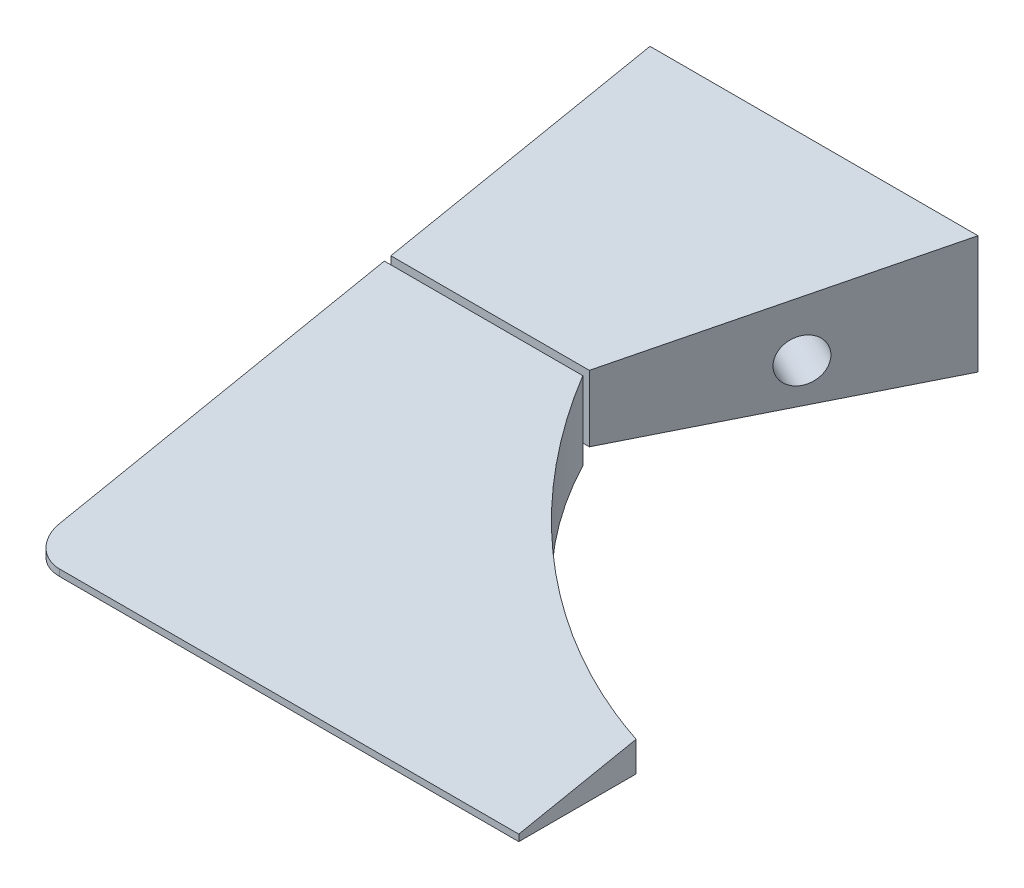
ISO-10303-21;
HEADER;
FILE_DESCRIPTION(('STEP AP214'),'2;1');
FILE_NAME('part.step','',(''),(''),'','','');
FILE_SCHEMA(('AUTOMOTIVE_DESIGN { 1 0 10303 214 1 1 1 1 }'));
ENDSEC;
DATA;
#1=APPLICATION_CONTEXT('core data for automotive mechanical design processes');
#2=APPLICATION_PROTOCOL_DEFINITION('international standard','automotive_design',2000,#1);
#3=PRODUCT_CONTEXT('',#1,'mechanical');
#4=PRODUCT('Part','Part','',(#3));
#5=PRODUCT_RELATED_PRODUCT_CATEGORY('part','',(#4));
#6=PRODUCT_DEFINITION_FORMATION('','',#4);
#7=PRODUCT_DEFINITION_CONTEXT('part definition',#1,'design');
#8=PRODUCT_DEFINITION('design','',#6,#7);
#9=PRODUCT_DEFINITION_SHAPE('','',#8);
#10=(LENGTH_UNIT() NAMED_UNIT(*) SI_UNIT(.MILLI.,.METRE.));
#11=(NAMED_UNIT(*) PLANE_ANGLE_UNIT() SI_UNIT($,.RADIAN.));
#12=(NAMED_UNIT(*) SI_UNIT($,.STERADIAN.) SOLID_ANGLE_UNIT());
#13=UNCERTAINTY_MEASURE_WITH_UNIT(LENGTH_MEASURE(1.E-05),#10,'distance_accuracy_value','');
#14=(GEOMETRIC_REPRESENTATION_CONTEXT(3) GLOBAL_UNCERTAINTY_ASSIGNED_CONTEXT((#13)) GLOBAL_UNIT_ASSIGNED_CONTEXT((#10,
#11,#12)) REPRESENTATION_CONTEXT('',''));
#15=CARTESIAN_POINT('',(0.,0.,0.));
#16=DIRECTION('',(0.,0.,1.));
#17=DIRECTION('',(1.,0.,0.));
#18=AXIS2_PLACEMENT_3D('',#15,#16,#17);
#19=CARTESIAN_POINT('',(0.,0.,95.));
#20=DIRECTION('',(0.,0.,1.));
#21=DIRECTION('',(1.,0.,0.));
#22=AXIS2_PLACEMENT_3D('',#19,#20,#21);
#23=PLANE('',#22);
#24=DIRECTION('',(0.,1.,0.));
#25=VECTOR('',#24,1.);
#26=CARTESIAN_POINT('',(9.99999999999999,-24.1308719192986,95.));
#27=LINE('',#26,#25);
#28=CARTESIAN_POINT('',(9.99999999999999,-10.,95.));
#29=VERTEX_POINT('',#28);
#30=CARTESIAN_POINT('',(10.,-9.,95.));
#31=VERTEX_POINT('',#30);
#32=EDGE_CURVE('E324',#29,#31,#27,.T.);
#33=ORIENTED_EDGE('',*,*,#32,.T.);
#34=DIRECTION('',(1.,0.,0.));
#35=VECTOR('',#34,1.);
#36=CARTESIAN_POINT('',(-330.312259244849,-9.,95.));
#37=LINE('',#36,#35);
#38=CARTESIAN_POINT('',(-60.,-9.,95.));
#39=VERTEX_POINT('',#38);
#40=EDGE_CURVE('E268',#39,#31,#37,.T.);
#41=ORIENTED_EDGE('',*,*,#40,.F.);
#42=DIRECTION('',(0.,-1.,0.));
#43=VECTOR('',#42,1.);
#44=CARTESIAN_POINT('',(-60.,-10.,95.));
#45=LINE('',#44,#43);
#46=CARTESIAN_POINT('',(-60.,-10.,95.));
#47=VERTEX_POINT('',#46);
#48=EDGE_CURVE('E291',#39,#47,#45,.T.);
#49=ORIENTED_EDGE('',*,*,#48,.T.);
#50=DIRECTION('',(1.,0.,0.));
#51=VECTOR('',#50,1.);
#52=CARTESIAN_POINT('',(-65.,-10.,95.));
#53=LINE('',#52,#51);
#54=EDGE_CURVE('E283',#47,#29,#53,.T.);
#55=ORIENTED_EDGE('',*,*,#54,.T.);
#56=EDGE_LOOP('',(#33,#41,#49,#55));
#57=FACE_BOUND('',#56,.T.);
#58=ADVANCED_FACE('F41',(#57),#23,.T.);
#59=CARTESIAN_POINT('',(-60.,0.,90.));
#60=DIRECTION('',(0.,1.,0.));
#61=DIRECTION('',(0.,0.,1.));
#62=AXIS2_PLACEMENT_3D('',#59,#60,#61);
#63=CYLINDRICAL_SURFACE('',#62,5.);
#64=CARTESIAN_POINT('',(-60.,-8.,90.));
#65=DIRECTION('',(0.,0.98058067569092,0.196116135138184));
#66=DIRECTION('',(0.,0.196116135138184,-0.98058067569092));
#67=AXIS2_PLACEMENT_3D('',#64,#65,#66);
#68=ELLIPSE('',#67,5.09901951359278,5.);
#69=CARTESIAN_POINT('',(-65.,-8.00000000000001,90.));
#70=VERTEX_POINT('',#69);
#71=EDGE_CURVE('E302',#70,#39,#68,.T.);
#72=ORIENTED_EDGE('',*,*,#71,.F.);
#73=DIRECTION('',(0.,-1.,0.));
#74=VECTOR('',#73,1.);
#75=CARTESIAN_POINT('',(-65.,-9.,90.));
#76=LINE('',#75,#74);
#77=CARTESIAN_POINT('',(-65.,-10.,90.));
#78=VERTEX_POINT('',#77);
#79=EDGE_CURVE('E298',#78,#70,#76,.F.);
#80=ORIENTED_EDGE('',*,*,#79,.F.);
#81=CARTESIAN_POINT('',(-60.,-10.,90.));
#82=DIRECTION('',(0.,1.,0.));
#83=DIRECTION('',(0.,0.,1.));
#84=AXIS2_PLACEMENT_3D('',#81,#82,#83);
#85=CIRCLE('',#84,5.);
#86=EDGE_CURVE('E295',#47,#78,#85,.F.);
#87=ORIENTED_EDGE('',*,*,#86,.F.);
#88=ORIENTED_EDGE('',*,*,#48,.F.);
#89=EDGE_LOOP('',(#72,#80,#87,#88));
#90=FACE_BOUND('',#89,.T.);
#91=ADVANCED_FACE('F43',(#90),#63,.T.);
#92=CARTESIAN_POINT('',(-330.312259244849,10.,0.));
#93=DIRECTION('',(0.,0.98058067569092,0.196116135138184));
#94=DIRECTION('',(0.,-0.196116135138184,0.98058067569092));
#95=AXIS2_PLACEMENT_3D('',#92,#93,#94);
#96=PLANE('',#95);
#97=DIRECTION('',(0.,-0.196116135138184,0.98058067569092));
#98=VECTOR('',#97,1.);
#99=CARTESIAN_POINT('',(9.99999999999999,-4.89894884237549,74.4947442118774));
#100=LINE('',#99,#98);
#101=CARTESIAN_POINT('',(9.99999999999999,-5.42196709872822,77.1098354936411));
#102=VERTEX_POINT('',#101);
#103=EDGE_CURVE('E175',#102,#31,#100,.T.);
#104=ORIENTED_EDGE('',*,*,#103,.F.);
#105=CARTESIAN_POINT('',(30.4043354410162,8.69431773620242,6.5284113189879));
#106=DIRECTION('',(0.,0.98058067569092,0.196116135138184));
#107=DIRECTION('',(0.,0.196116135138184,-0.98058067569092));
#108=AXIS2_PLACEMENT_3D('',#105,#106,#107);
#109=ELLIPSE('',#108,74.9266128758287,73.4715886810121);
#110=CARTESIAN_POINT('',(-34.741696715977,1.9,40.5));
#111=VERTEX_POINT('',#110);
#112=EDGE_CURVE('E272',#111,#102,#109,.T.);
#113=ORIENTED_EDGE('',*,*,#112,.F.);
#114=DIRECTION('',(-1.,0.,0.));
#115=VECTOR('',#114,1.);
#116=CARTESIAN_POINT('',(-330.312259244849,1.9,40.5));
#117=LINE('',#116,#115);
#118=CARTESIAN_POINT('',(-65.,1.9,40.5));
#119=VERTEX_POINT('',#118);
#120=EDGE_CURVE('E50',#111,#119,#117,.T.);
#121=ORIENTED_EDGE('',*,*,#120,.T.);
#122=DIRECTION('',(0.,-0.196116135138184,0.98058067569092));
#123=VECTOR('',#122,1.);
#124=CARTESIAN_POINT('',(-65.,-8.26923076923077,91.3461538461538));
#125=LINE('',#124,#123);
#126=EDGE_CURVE('E276',#119,#70,#125,.T.);
#127=ORIENTED_EDGE('',*,*,#126,.T.);
#128=ORIENTED_EDGE('',*,*,#71,.T.);
#129=ORIENTED_EDGE('',*,*,#40,.T.);
#130=EDGE_LOOP('',(#104,#113,#121,#127,#128,#129));
#131=FACE_BOUND('',#130,.T.);
#132=ADVANCED_FACE('F311',(#131),#96,.T.);
#133=CARTESIAN_POINT('',(-65.,-10.,95.));
#134=DIRECTION('',(0.,1.,0.));
#135=DIRECTION('',(0.,0.,1.));
#136=AXIS2_PLACEMENT_3D('',#133,#134,#135);
#137=PLANE('',#136);
#138=CARTESIAN_POINT('',(30.4043354410162,-10.,6.5284113189879));
#139=DIRECTION('',(0.,1.,0.));
#140=DIRECTION('',(0.,0.,1.));
#141=AXIS2_PLACEMENT_3D('',#138,#139,#140);
#142=CIRCLE('',#141,73.4715886810121);
#143=CARTESIAN_POINT('',(-34.7416967159767,-10.,40.5));
#144=VERTEX_POINT('',#143);
#145=CARTESIAN_POINT('',(9.99999999999999,-10.,77.1098354936411));
#146=VERTEX_POINT('',#145);
#147=EDGE_CURVE('E279',#144,#146,#142,.T.);
#148=ORIENTED_EDGE('',*,*,#147,.T.);
#149=DIRECTION('',(0.,0.,-1.));
#150=VECTOR('',#149,1.);
#151=CARTESIAN_POINT('',(9.99999999999999,-10.,70.6483595964928));
#152=LINE('',#151,#150);
#153=EDGE_CURVE('E64',#29,#146,#152,.T.);
#154=ORIENTED_EDGE('',*,*,#153,.F.);
#155=ORIENTED_EDGE('',*,*,#54,.F.);
#156=ORIENTED_EDGE('',*,*,#86,.T.);
#157=DIRECTION('',(0.,0.,-1.));
#158=VECTOR('',#157,1.);
#159=CARTESIAN_POINT('',(-65.,-10.,95.));
#160=LINE('',#159,#158);
#161=CARTESIAN_POINT('',(-65.,-10.,40.5));
#162=VERTEX_POINT('',#161);
#163=EDGE_CURVE('E287',#78,#162,#160,.T.);
#164=ORIENTED_EDGE('',*,*,#163,.T.);
#165=DIRECTION('',(-1.,0.,0.));
#166=VECTOR('',#165,1.);
#167=CARTESIAN_POINT('',(65.,-10.,40.5));
#168=LINE('',#167,#166);
#169=EDGE_CURVE('E261',#144,#162,#168,.T.);
#170=ORIENTED_EDGE('',*,*,#169,.F.);
#171=EDGE_LOOP('',(#148,#154,#155,#156,#164,#170));
#172=FACE_BOUND('',#171,.T.);
#173=ADVANCED_FACE('F339',(#172),#137,.F.);
#174=CARTESIAN_POINT('',(30.4043354410162,-10.001,6.5284113189879));
#175=DIRECTION('',(0.,1.,0.));
#176=DIRECTION('',(0.,0.,1.));
#177=AXIS2_PLACEMENT_3D('',#174,#175,#176);
#178=CYLINDRICAL_SURFACE('',#177,73.4715886810121);
#179=DIRECTION('',(0.,1.,0.));
#180=VECTOR('',#179,1.);
#181=CARTESIAN_POINT('',(10.,-10.001,77.1098354936411));
#182=LINE('',#181,#180);
#183=EDGE_CURVE('E326',#102,#146,#182,.F.);
#184=ORIENTED_EDGE('',*,*,#183,.T.);
#185=ORIENTED_EDGE('',*,*,#147,.F.);
#186=DIRECTION('',(0.,1.,0.));
#187=VECTOR('',#186,1.);
#188=CARTESIAN_POINT('',(-34.7416967159767,-10.001,40.5));
#189=LINE('',#188,#187);
#190=EDGE_CURVE('E265',#144,#111,#189,.T.);
#191=ORIENTED_EDGE('',*,*,#190,.T.);
#192=ORIENTED_EDGE('',*,*,#112,.T.);
#193=EDGE_LOOP('',(#184,#185,#191,#192));
#194=FACE_BOUND('',#193,.T.);
#195=ADVANCED_FACE('F336',(#194),#178,.F.);
#196=CARTESIAN_POINT('',(-65.,10.,95.));
#197=DIRECTION('',(1.,0.,0.));
#198=DIRECTION('',(0.,0.,-1.));
#199=AXIS2_PLACEMENT_3D('',#196,#197,#198);
#200=PLANE('',#199);
#201=DIRECTION('',(0.,-1.,0.));
#202=VECTOR('',#201,1.);
#203=CARTESIAN_POINT('',(-65.,0.,40.5));
#204=LINE('',#203,#202);
#205=EDGE_CURVE('E231',#119,#162,#204,.T.);
#206=ORIENTED_EDGE('',*,*,#205,.T.);
#207=ORIENTED_EDGE('',*,*,#163,.F.);
#208=ORIENTED_EDGE('',*,*,#79,.T.);
#209=ORIENTED_EDGE('',*,*,#126,.F.);
#210=EDGE_LOOP('',(#206,#207,#208,#209));
#211=FACE_BOUND('',#210,.T.);
#212=ADVANCED_FACE('F314',(#211),#200,.F.);
#213=CARTESIAN_POINT('',(65.,0.,40.5));
#214=DIRECTION('',(0.,0.,-1.));
#215=DIRECTION('',(-1.,0.,0.));
#216=AXIS2_PLACEMENT_3D('',#213,#214,#215);
#217=PLANE('',#216);
#218=ORIENTED_EDGE('',*,*,#120,.F.);
#219=ORIENTED_EDGE('',*,*,#190,.F.);
#220=ORIENTED_EDGE('',*,*,#169,.T.);
#221=ORIENTED_EDGE('',*,*,#205,.F.);
#222=EDGE_LOOP('',(#218,#219,#220,#221));
#223=FACE_BOUND('',#222,.T.);
#224=DIRECTION('',(1.,0.,0.));
#225=VECTOR('',#224,1.);
#226=CARTESIAN_POINT('',(-64.,0.899999999999995,40.5));
#227=LINE('',#226,#225);
#228=CARTESIAN_POINT('',(-64.,0.899999999999995,40.5));
#229=VERTEX_POINT('',#228);
#230=CARTESIAN_POINT('',(-35.7416967159767,0.899999999999996,40.5));
#231=VERTEX_POINT('',#230);
#232=EDGE_CURVE('E214',#229,#231,#227,.T.);
#233=ORIENTED_EDGE('',*,*,#232,.F.);
#234=DIRECTION('',(0.,1.,0.));
#235=VECTOR('',#234,1.);
#236=CARTESIAN_POINT('',(-64.,0.899999999999995,40.5));
#237=LINE('',#236,#235);
#238=CARTESIAN_POINT('',(-64.,-7.,40.5));
#239=VERTEX_POINT('',#238);
#240=EDGE_CURVE('E218',#239,#229,#237,.T.);
#241=ORIENTED_EDGE('',*,*,#240,.F.);
#242=DIRECTION('',(-1.,0.,0.));
#243=VECTOR('',#242,1.);
#244=CARTESIAN_POINT('',(-64.,-7.,40.5));
#245=LINE('',#244,#243);
#246=CARTESIAN_POINT('',(-35.7416967159767,-7.,40.5));
#247=VERTEX_POINT('',#246);
#248=EDGE_CURVE('E222',#247,#239,#245,.T.);
#249=ORIENTED_EDGE('',*,*,#248,.F.);
#250=DIRECTION('',(0.,-1.,0.));
#251=VECTOR('',#250,1.);
#252=CARTESIAN_POINT('',(-35.7416967159767,0.899999999999996,40.5));
#253=LINE('',#252,#251);
#254=EDGE_CURVE('E208',#231,#247,#253,.T.);
#255=ORIENTED_EDGE('',*,*,#254,.F.);
#256=EDGE_LOOP('',(#233,#241,#249,#255));
#257=FACE_BOUND('',#256,.T.);
#258=ADVANCED_FACE('F340',(#223,#257),#217,.T.);
#259=CARTESIAN_POINT('',(-35.7416967159767,0.899999999999996,95.002));
#260=DIRECTION('',(-1.,0.,0.));
#261=DIRECTION('',(0.,0.,1.));
#262=AXIS2_PLACEMENT_3D('',#259,#260,#261);
#263=PLANE('',#262);
#264=DIRECTION('',(0.,0.,-1.));
#265=VECTOR('',#264,1.);
#266=CARTESIAN_POINT('',(-35.7416967159767,0.899999999999996,95.002));
#267=LINE('',#266,#265);
#268=CARTESIAN_POINT('',(-35.7416967159767,0.899999999999996,39.5));
#269=VERTEX_POINT('',#268);
#270=EDGE_CURVE('E226',#231,#269,#267,.T.);
#271=ORIENTED_EDGE('',*,*,#270,.F.);
#272=ORIENTED_EDGE('',*,*,#254,.T.);
#273=DIRECTION('',(0.,0.,-1.));
#274=VECTOR('',#273,1.);
#275=CARTESIAN_POINT('',(-35.7416967159767,-7.,95.002));
#276=LINE('',#275,#274);
#277=CARTESIAN_POINT('',(-35.7416967159767,-7.,39.5));
#278=VERTEX_POINT('',#277);
#279=EDGE_CURVE('E238',#247,#278,#276,.T.);
#280=ORIENTED_EDGE('',*,*,#279,.T.);
#281=DIRECTION('',(0.,1.,0.));
#282=VECTOR('',#281,1.);
#283=CARTESIAN_POINT('',(-35.7416967159767,0.899999999999996,39.5));
#284=LINE('',#283,#282);
#285=EDGE_CURVE('E227',#278,#269,#284,.T.);
#286=ORIENTED_EDGE('',*,*,#285,.T.);
#287=EDGE_LOOP('',(#271,#272,#280,#286));
#288=FACE_BOUND('',#287,.T.);
#289=ADVANCED_FACE('F343',(#288),#263,.F.);
#290=CARTESIAN_POINT('',(-64.,0.899999999999995,95.002));
#291=DIRECTION('',(0.,-1.,0.));
#292=DIRECTION('',(1.,0.,0.));
#293=AXIS2_PLACEMENT_3D('',#290,#291,#292);
#294=PLANE('',#293);
#295=DIRECTION('',(0.,0.,-1.));
#296=VECTOR('',#295,1.);
#297=CARTESIAN_POINT('',(-64.,0.899999999999995,95.002));
#298=LINE('',#297,#296);
#299=CARTESIAN_POINT('',(-64.,0.899999999999995,39.5));
#300=VERTEX_POINT('',#299);
#301=EDGE_CURVE('E248',#229,#300,#298,.T.);
#302=ORIENTED_EDGE('',*,*,#301,.F.);
#303=ORIENTED_EDGE('',*,*,#232,.T.);
#304=ORIENTED_EDGE('',*,*,#270,.T.);
#305=DIRECTION('',(-1.,0.,0.));
#306=VECTOR('',#305,1.);
#307=CARTESIAN_POINT('',(-64.,0.899999999999995,39.5));
#308=LINE('',#307,#306);
#309=EDGE_CURVE('E233',#269,#300,#308,.T.);
#310=ORIENTED_EDGE('',*,*,#309,.T.);
#311=EDGE_LOOP('',(#302,#303,#304,#310));
#312=FACE_BOUND('',#311,.T.);
#313=ADVANCED_FACE('F352',(#312),#294,.F.);
#314=CARTESIAN_POINT('',(-64.,0.899999999999995,95.002));
#315=DIRECTION('',(1.,0.,0.));
#316=DIRECTION('',(0.,0.,-1.));
#317=AXIS2_PLACEMENT_3D('',#314,#315,#316);
#318=PLANE('',#317);
#319=DIRECTION('',(0.,0.,-1.));
#320=VECTOR('',#319,1.);
#321=CARTESIAN_POINT('',(-64.,-7.,95.002));
#322=LINE('',#321,#320);
#323=CARTESIAN_POINT('',(-64.,-7.,39.5));
#324=VERTEX_POINT('',#323);
#325=EDGE_CURVE('E252',#239,#324,#322,.T.);
#326=ORIENTED_EDGE('',*,*,#325,.F.);
#327=ORIENTED_EDGE('',*,*,#240,.T.);
#328=ORIENTED_EDGE('',*,*,#301,.T.);
#329=DIRECTION('',(0.,-1.,0.));
#330=VECTOR('',#329,1.);
#331=CARTESIAN_POINT('',(-64.,0.899999999999995,39.5));
#332=LINE('',#331,#330);
#333=EDGE_CURVE('E237',#300,#324,#332,.T.);
#334=ORIENTED_EDGE('',*,*,#333,.T.);
#335=EDGE_LOOP('',(#326,#327,#328,#334));
#336=FACE_BOUND('',#335,.T.);
#337=ADVANCED_FACE('F351',(#336),#318,.F.);
#338=CARTESIAN_POINT('',(-64.,-7.,95.002));
#339=DIRECTION('',(0.,1.,0.));
#340=DIRECTION('',(0.,0.,1.));
#341=AXIS2_PLACEMENT_3D('',#338,#339,#340);
#342=PLANE('',#341);
#343=ORIENTED_EDGE('',*,*,#279,.F.);
#344=ORIENTED_EDGE('',*,*,#248,.T.);
#345=ORIENTED_EDGE('',*,*,#325,.T.);
#346=DIRECTION('',(1.,0.,0.));
#347=VECTOR('',#346,1.);
#348=CARTESIAN_POINT('',(-64.,-7.,39.5));
#349=LINE('',#348,#347);
#350=EDGE_CURVE('E232',#324,#278,#349,.T.);
#351=ORIENTED_EDGE('',*,*,#350,.T.);
#352=EDGE_LOOP('',(#343,#344,#345,#351));
#353=FACE_BOUND('',#352,.T.);
#354=ADVANCED_FACE('F345',(#353),#342,.F.);
#355=CARTESIAN_POINT('',(-65.,10.,95.));
#356=DIRECTION('',(1.,0.,0.));
#357=DIRECTION('',(0.,0.,-1.));
#358=AXIS2_PLACEMENT_3D('',#355,#356,#357);
#359=PLANE('',#358);
#360=CARTESIAN_POINT('',(-65.,-2.,20.));
#361=DIRECTION('',(-1.,0.,0.));
#362=DIRECTION('',(0.,0.,1.));
#363=AXIS2_PLACEMENT_3D('',#360,#361,#362);
#364=CIRCLE('',#363,3.28999849999999);
#365=CARTESIAN_POINT('',(-65.,-2.,23.2899985));
#366=VERTEX_POINT('',#365);
#367=EDGE_CURVE('E190',#366,#366,#364,.T.);
#368=ORIENTED_EDGE('',*,*,#367,.F.);
#369=EDGE_LOOP('',(#368));
#370=FACE_BOUND('',#369,.T.);
#371=DIRECTION('',(0.,-1.,0.));
#372=VECTOR('',#371,1.);
#373=CARTESIAN_POINT('',(-65.,10.,0.));
#374=LINE('',#373,#372);
#375=CARTESIAN_POINT('',(-65.,10.,0.));
#376=VERTEX_POINT('',#375);
#377=CARTESIAN_POINT('',(-65.,-8.00000000000001,0.));
#378=VERTEX_POINT('',#377);
#379=EDGE_CURVE('E161',#376,#378,#374,.T.);
#380=ORIENTED_EDGE('',*,*,#379,.T.);
#381=DIRECTION('',(0.,0.,-1.));
#382=VECTOR('',#381,1.);
#383=CARTESIAN_POINT('',(-65.,-8.00000000000001,40.5));
#384=LINE('',#383,#382);
#385=CARTESIAN_POINT('',(-65.,-8.00000000000001,39.5));
#386=VERTEX_POINT('',#385);
#387=EDGE_CURVE('E146',#386,#378,#384,.T.);
#388=ORIENTED_EDGE('',*,*,#387,.F.);
#389=DIRECTION('',(0.,-1.,0.));
#390=VECTOR('',#389,1.);
#391=CARTESIAN_POINT('',(-65.,0.,39.5));
#392=LINE('',#391,#390);
#393=CARTESIAN_POINT('',(-65.,2.1,39.5));
#394=VERTEX_POINT('',#393);
#395=EDGE_CURVE('E205',#394,#386,#392,.T.);
#396=ORIENTED_EDGE('',*,*,#395,.F.);
#397=DIRECTION('',(0.,-0.196116135138184,0.98058067569092));
#398=VECTOR('',#397,1.);
#399=CARTESIAN_POINT('',(-65.,-8.26923076923077,91.3461538461538));
#400=LINE('',#399,#398);
#401=EDGE_CURVE('E168',#376,#394,#400,.T.);
#402=ORIENTED_EDGE('',*,*,#401,.F.);
#403=EDGE_LOOP('',(#380,#388,#396,#402));
#404=FACE_BOUND('',#403,.T.);
#405=ADVANCED_FACE('F166',(#370,#404),#359,.F.);
#406=CARTESIAN_POINT('',(-35.,-10.001,40.));
#407=DIRECTION('',(0.894427190999916,0.,0.447213595499958));
#408=DIRECTION('',(0.447213595499958,0.,-0.894427190999916));
#409=AXIS2_PLACEMENT_3D('',#406,#407,#408);
#410=PLANE('',#409);
#411=DIRECTION('',(-0.447213595499958,0.,0.894427190999916));
#412=VECTOR('',#411,1.);
#413=CARTESIAN_POINT('',(-35.,-8.00000000000001,40.));
#414=LINE('',#413,#412);
#415=CARTESIAN_POINT('',(-15.,-8.00000000000001,0.));
#416=VERTEX_POINT('',#415);
#417=CARTESIAN_POINT('',(-34.75,-8.00000000000001,39.5));
#418=VERTEX_POINT('',#417);
#419=EDGE_CURVE('E57',#416,#418,#414,.T.);
#420=ORIENTED_EDGE('',*,*,#419,.F.);
#421=DIRECTION('',(0.,1.,0.));
#422=VECTOR('',#421,1.);
#423=CARTESIAN_POINT('',(-15.,-10.001,0.));
#424=LINE('',#423,#422);
#425=CARTESIAN_POINT('',(-15.,10.,0.));
#426=VERTEX_POINT('',#425);
#427=EDGE_CURVE('E163',#416,#426,#424,.T.);
#428=ORIENTED_EDGE('',*,*,#427,.T.);
#429=DIRECTION('',(-0.440225453162812,-0.176090181265125,0.880450906325624));
#430=VECTOR('',#429,1.);
#431=CARTESIAN_POINT('',(-35.9303100775194,1.62787596899225,41.8606201550388));
#432=LINE('',#431,#430);
#433=CARTESIAN_POINT('',(-34.7500000000001,2.09999999999999,39.5));
#434=VERTEX_POINT('',#433);
#435=EDGE_CURVE('E173',#426,#434,#432,.T.);
#436=ORIENTED_EDGE('',*,*,#435,.T.);
#437=DIRECTION('',(0.,1.,0.));
#438=VECTOR('',#437,1.);
#439=CARTESIAN_POINT('',(-34.75,-10.001,39.5));
#440=LINE('',#439,#438);
#441=EDGE_CURVE('E202',#418,#434,#440,.T.);
#442=ORIENTED_EDGE('',*,*,#441,.F.);
#443=EDGE_LOOP('',(#420,#428,#436,#442));
#444=FACE_BOUND('',#443,.T.);
#445=CARTESIAN_POINT('',(-23.9442719099992,-2.,17.8885438199983));
#446=DIRECTION('',(0.894427190999916,0.,0.447213595499958));
#447=DIRECTION('',(0.447213595499958,0.,-0.894427190999916));
#448=AXIS2_PLACEMENT_3D('',#445,#446,#447);
#449=CIRCLE('',#448,3.28999849999999);
#450=CARTESIAN_POINT('',(-22.4729398516247,-2.,14.9458797032494));
#451=VERTEX_POINT('',#450);
#452=EDGE_CURVE('E198',#451,#451,#449,.T.);
#453=ORIENTED_EDGE('',*,*,#452,.F.);
#454=EDGE_LOOP('',(#453));
#455=FACE_BOUND('',#454,.T.);
#456=ADVANCED_FACE('F367',(#444,#455),#410,.T.);
#457=CARTESIAN_POINT('',(0.,0.,0.));
#458=DIRECTION('',(0.,0.,1.));
#459=DIRECTION('',(1.,0.,0.));
#460=AXIS2_PLACEMENT_3D('',#457,#458,#459);
#461=PLANE('',#460);
#462=ORIENTED_EDGE('',*,*,#427,.F.);
#463=DIRECTION('',(1.,0.,0.));
#464=VECTOR('',#463,1.);
#465=CARTESIAN_POINT('',(-65.,-8.00000000000001,0.));
#466=LINE('',#465,#464);
#467=EDGE_CURVE('E149',#378,#416,#466,.T.);
#468=ORIENTED_EDGE('',*,*,#467,.F.);
#469=ORIENTED_EDGE('',*,*,#379,.F.);
#470=DIRECTION('',(-1.,0.,0.));
#471=VECTOR('',#470,1.);
#472=CARTESIAN_POINT('',(-65.,10.,0.));
#473=LINE('',#472,#471);
#474=EDGE_CURVE('E180',#426,#376,#473,.T.);
#475=ORIENTED_EDGE('',*,*,#474,.F.);
#476=EDGE_LOOP('',(#462,#468,#469,#475));
#477=FACE_BOUND('',#476,.T.);
#478=ADVANCED_FACE('F159',(#477),#461,.F.);
#479=CARTESIAN_POINT('',(-330.312259244849,10.,0.));
#480=DIRECTION('',(0.,0.98058067569092,0.196116135138184));
#481=DIRECTION('',(0.,-0.196116135138184,0.98058067569092));
#482=AXIS2_PLACEMENT_3D('',#479,#480,#481);
#483=PLANE('',#482);
#484=DIRECTION('',(-1.,0.,0.));
#485=VECTOR('',#484,1.);
#486=CARTESIAN_POINT('',(-330.312259244849,2.1,39.5));
#487=LINE('',#486,#485);
#488=EDGE_CURVE('E179',#434,#394,#487,.T.);
#489=ORIENTED_EDGE('',*,*,#488,.F.);
#490=ORIENTED_EDGE('',*,*,#435,.F.);
#491=ORIENTED_EDGE('',*,*,#474,.T.);
#492=ORIENTED_EDGE('',*,*,#401,.T.);
#493=EDGE_LOOP('',(#489,#490,#491,#492));
#494=FACE_BOUND('',#493,.T.);
#495=ADVANCED_FACE('F432',(#494),#483,.T.);
#496=CARTESIAN_POINT('',(-55.,-2.,20.));
#497=DIRECTION('',(-1.,0.,0.));
#498=DIRECTION('',(0.,0.,1.));
#499=AXIS2_PLACEMENT_3D('',#496,#497,#498);
#500=CONICAL_SURFACE('',#499,3.28999849999999,1.02974425867665);
#501=CARTESIAN_POINT('',(-53.0231694646903,-2.,20.));
#502=VERTEX_POINT('',#501);
#503=VERTEX_LOOP('',#502);
#504=FACE_BOUND('',#503,.T.);
#505=CARTESIAN_POINT('',(-55.,-2.,20.));
#506=DIRECTION('',(-1.,0.,0.));
#507=DIRECTION('',(0.,0.,1.));
#508=AXIS2_PLACEMENT_3D('',#505,#506,#507);
#509=CIRCLE('',#508,3.28999849999999);
#510=CARTESIAN_POINT('',(-55.,-2.,23.2899985));
#511=VERTEX_POINT('',#510);
#512=EDGE_CURVE('E186',#511,#511,#509,.T.);
#513=ORIENTED_EDGE('',*,*,#512,.T.);
#514=EDGE_LOOP('',(#513));
#515=FACE_BOUND('',#514,.T.);
#516=ADVANCED_FACE('F437',(#504,#515),#500,.F.);
#517=CARTESIAN_POINT('',(-65.,-2.,20.));
#518=DIRECTION('',(-1.,0.,0.));
#519=DIRECTION('',(0.,0.,1.));
#520=AXIS2_PLACEMENT_3D('',#517,#518,#519);
#521=CYLINDRICAL_SURFACE('',#520,3.28999849999999);
#522=ORIENTED_EDGE('',*,*,#512,.F.);
#523=EDGE_LOOP('',(#522));
#524=FACE_BOUND('',#523,.T.);
#525=ORIENTED_EDGE('',*,*,#367,.T.);
#526=EDGE_LOOP('',(#525));
#527=FACE_BOUND('',#526,.T.);
#528=ADVANCED_FACE('F449',(#524,#527),#521,.F.);
#529=CARTESIAN_POINT('',(-32.8885438199983,-2.,13.4164078649987));
#530=DIRECTION('',(0.894427190999916,0.,0.447213595499958));
#531=DIRECTION('',(0.447213595499958,0.,-0.894427190999916));
#532=AXIS2_PLACEMENT_3D('',#529,#530,#531);
#533=CONICAL_SURFACE('',#532,3.28999849999999,1.02974425867665);
#534=CARTESIAN_POINT('',(-34.6566748027783,-2.,12.5323423736088));
#535=VERTEX_POINT('',#534);
#536=VERTEX_LOOP('',#535);
#537=FACE_BOUND('',#536,.T.);
#538=CARTESIAN_POINT('',(-32.8885438199983,-2.,13.4164078649987));
#539=DIRECTION('',(0.894427190999916,0.,0.447213595499958));
#540=DIRECTION('',(0.447213595499958,0.,-0.894427190999916));
#541=AXIS2_PLACEMENT_3D('',#538,#539,#540);
#542=CIRCLE('',#541,3.28999849999999);
#543=CARTESIAN_POINT('',(-31.4172117616239,-2.,10.4737437482498));
#544=VERTEX_POINT('',#543);
#545=EDGE_CURVE('E194',#544,#544,#542,.T.);
#546=ORIENTED_EDGE('',*,*,#545,.T.);
#547=EDGE_LOOP('',(#546));
#548=FACE_BOUND('',#547,.T.);
#549=ADVANCED_FACE('F459',(#537,#548),#533,.F.);
#550=CARTESIAN_POINT('',(-23.9442719099992,-2.,17.8885438199983));
#551=DIRECTION('',(0.894427190999916,0.,0.447213595499958));
#552=DIRECTION('',(0.447213595499958,0.,-0.894427190999916));
#553=AXIS2_PLACEMENT_3D('',#550,#551,#552);
#554=CYLINDRICAL_SURFACE('',#553,3.28999849999999);
#555=ORIENTED_EDGE('',*,*,#545,.F.);
#556=EDGE_LOOP('',(#555));
#557=FACE_BOUND('',#556,.T.);
#558=ORIENTED_EDGE('',*,*,#452,.T.);
#559=EDGE_LOOP('',(#558));
#560=FACE_BOUND('',#559,.T.);
#561=ADVANCED_FACE('F469',(#557,#560),#554,.F.);
#562=CARTESIAN_POINT('',(65.,0.,39.5));
#563=DIRECTION('',(0.,0.,-1.));
#564=DIRECTION('',(-1.,0.,0.));
#565=AXIS2_PLACEMENT_3D('',#562,#563,#564);
#566=PLANE('',#565);
#567=ORIENTED_EDGE('',*,*,#285,.F.);
#568=ORIENTED_EDGE('',*,*,#350,.F.);
#569=ORIENTED_EDGE('',*,*,#333,.F.);
#570=ORIENTED_EDGE('',*,*,#309,.F.);
#571=EDGE_LOOP('',(#567,#568,#569,#570));
#572=FACE_BOUND('',#571,.T.);
#573=ORIENTED_EDGE('',*,*,#395,.T.);
#574=DIRECTION('',(1.,0.,0.));
#575=VECTOR('',#574,1.);
#576=CARTESIAN_POINT('',(65.,-8.00000000000002,39.5));
#577=LINE('',#576,#575);
#578=EDGE_CURVE('E11',#386,#418,#577,.T.);
#579=ORIENTED_EDGE('',*,*,#578,.T.);
#580=ORIENTED_EDGE('',*,*,#441,.T.);
#581=ORIENTED_EDGE('',*,*,#488,.T.);
#582=EDGE_LOOP('',(#573,#579,#580,#581));
#583=FACE_BOUND('',#582,.T.);
#584=ADVANCED_FACE('F354',(#572,#583),#566,.F.);
#585=CARTESIAN_POINT('',(9.99999999999999,-24.1308719192986,70.6483595964928));
#586=DIRECTION('',(-1.,0.,0.));
#587=DIRECTION('',(0.,0.,1.));
#588=AXIS2_PLACEMENT_3D('',#585,#586,#587);
#589=PLANE('',#588);
#590=ORIENTED_EDGE('',*,*,#153,.T.);
#591=ORIENTED_EDGE('',*,*,#183,.F.);
#592=ORIENTED_EDGE('',*,*,#103,.T.);
#593=ORIENTED_EDGE('',*,*,#32,.F.);
#594=EDGE_LOOP('',(#590,#591,#592,#593));
#595=FACE_BOUND('',#594,.T.);
#596=ADVANCED_FACE('F490',(#595),#589,.F.);
#597=CARTESIAN_POINT('',(-65.,-8.00000000000001,40.5));
#598=DIRECTION('',(0.,1.,0.));
#599=DIRECTION('',(-1.,0.,0.));
#600=AXIS2_PLACEMENT_3D('',#597,#598,#599);
#601=PLANE('',#600);
#602=ORIENTED_EDGE('',*,*,#419,.T.);
#603=ORIENTED_EDGE('',*,*,#578,.F.);
#604=ORIENTED_EDGE('',*,*,#387,.T.);
#605=ORIENTED_EDGE('',*,*,#467,.T.);
#606=EDGE_LOOP('',(#602,#603,#604,#605));
#607=FACE_BOUND('',#606,.T.);
#608=ADVANCED_FACE('F148',(#607),#601,.F.);
#609=CLOSED_SHELL('',(#58,#91,#132,#173,#195,#212,#258,#289,#313,#337,#354,#405,#456,#478,#495,
#516,#528,#549,#561,#584,#596,#608));
#610=MANIFOLD_SOLID_BREP('B2',#609);
#611=ADVANCED_BREP_SHAPE_REPRESENTATION('',(#18,#610),#14);
#612=SHAPE_DEFINITION_REPRESENTATION(#9,#611);
ENDSEC;
END-ISO-10303-21;
